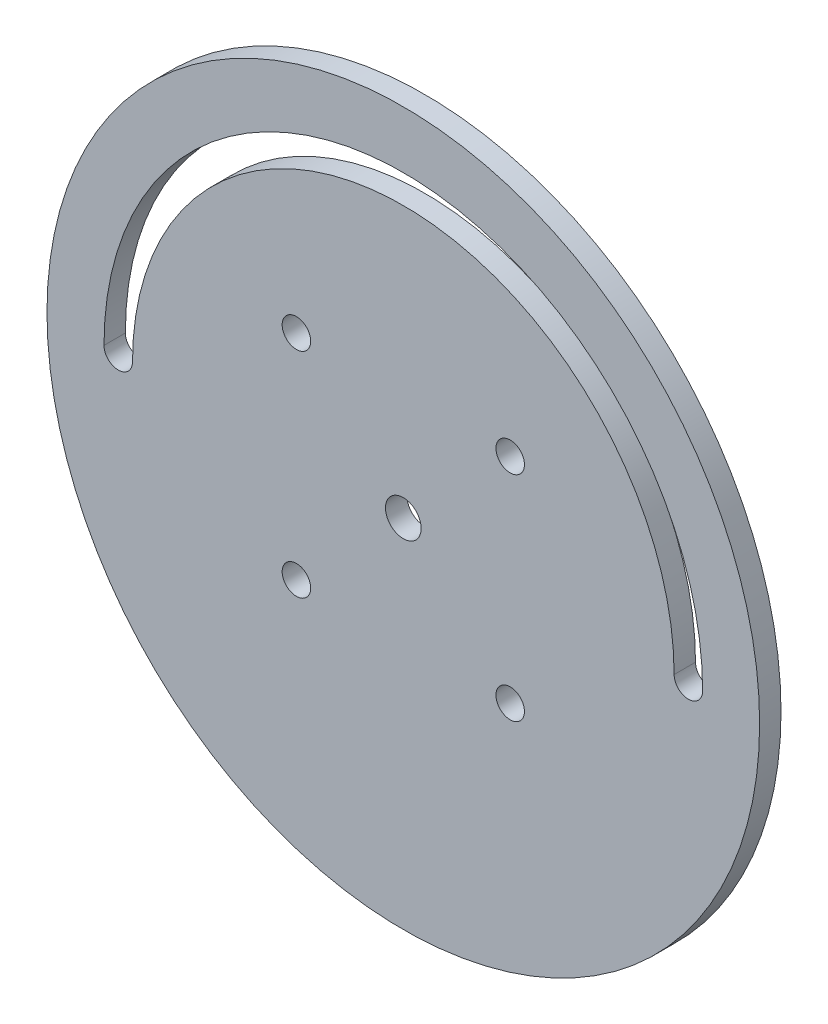
ISO-10303-21;
HEADER;
FILE_DESCRIPTION(('STEP AP214'),'2;1');
FILE_NAME('part.step','',(''),(''),'','','');
FILE_SCHEMA(('AUTOMOTIVE_DESIGN { 1 0 10303 214 1 1 1 1 }'));
ENDSEC;
DATA;
#1=APPLICATION_CONTEXT('core data for automotive mechanical design processes');
#2=APPLICATION_PROTOCOL_DEFINITION('international standard','automotive_design',2000,#1);
#3=PRODUCT_CONTEXT('',#1,'mechanical');
#4=PRODUCT('Part','Part','',(#3));
#5=PRODUCT_RELATED_PRODUCT_CATEGORY('part','',(#4));
#6=PRODUCT_DEFINITION_FORMATION('','',#4);
#7=PRODUCT_DEFINITION_CONTEXT('part definition',#1,'design');
#8=PRODUCT_DEFINITION('design','',#6,#7);
#9=PRODUCT_DEFINITION_SHAPE('','',#8);
#10=(LENGTH_UNIT() NAMED_UNIT(*) SI_UNIT(.MILLI.,.METRE.));
#11=(NAMED_UNIT(*) PLANE_ANGLE_UNIT() SI_UNIT($,.RADIAN.));
#12=(NAMED_UNIT(*) SI_UNIT($,.STERADIAN.) SOLID_ANGLE_UNIT());
#13=UNCERTAINTY_MEASURE_WITH_UNIT(LENGTH_MEASURE(1.E-05),#10,'distance_accuracy_value','');
#14=(GEOMETRIC_REPRESENTATION_CONTEXT(3) GLOBAL_UNCERTAINTY_ASSIGNED_CONTEXT((#13)) GLOBAL_UNIT_ASSIGNED_CONTEXT((#10,
#11,#12)) REPRESENTATION_CONTEXT('',''));
#15=CARTESIAN_POINT('',(0.,0.,0.));
#16=DIRECTION('',(0.,0.,1.));
#17=DIRECTION('',(1.,0.,0.));
#18=AXIS2_PLACEMENT_3D('',#15,#16,#17);
#19=CARTESIAN_POINT('',(0.,0.,3.));
#20=DIRECTION('',(0.,0.,1.));
#21=DIRECTION('',(1.,0.,0.));
#22=AXIS2_PLACEMENT_3D('',#19,#20,#21);
#23=PLANE('',#22);
#24=CARTESIAN_POINT('',(-15.,-15.,3.));
#25=DIRECTION('',(0.,0.,1.));
#26=DIRECTION('',(1.,0.,0.));
#27=AXIS2_PLACEMENT_3D('',#24,#25,#26);
#28=CIRCLE('',#27,2.);
#29=CARTESIAN_POINT('',(-13.,-15.,3.));
#30=VERTEX_POINT('',#29);
#31=EDGE_CURVE('E220',#30,#30,#28,.T.);
#32=ORIENTED_EDGE('',*,*,#31,.F.);
#33=EDGE_LOOP('',(#32));
#34=FACE_BOUND('',#33,.T.);
#35=CARTESIAN_POINT('',(15.,-15.,3.));
#36=DIRECTION('',(0.,0.,1.));
#37=DIRECTION('',(1.,0.,0.));
#38=AXIS2_PLACEMENT_3D('',#35,#36,#37);
#39=CIRCLE('',#38,2.);
#40=CARTESIAN_POINT('',(17.,-15.,3.));
#41=VERTEX_POINT('',#40);
#42=EDGE_CURVE('E222',#41,#41,#39,.T.);
#43=ORIENTED_EDGE('',*,*,#42,.F.);
#44=EDGE_LOOP('',(#43));
#45=FACE_BOUND('',#44,.T.);
#46=CARTESIAN_POINT('',(15.,15.,3.));
#47=DIRECTION('',(0.,0.,1.));
#48=DIRECTION('',(1.,0.,0.));
#49=AXIS2_PLACEMENT_3D('',#46,#47,#48);
#50=CIRCLE('',#49,2.);
#51=CARTESIAN_POINT('',(17.,15.,3.));
#52=VERTEX_POINT('',#51);
#53=EDGE_CURVE('E243',#52,#52,#50,.T.);
#54=ORIENTED_EDGE('',*,*,#53,.F.);
#55=EDGE_LOOP('',(#54));
#56=FACE_BOUND('',#55,.T.);
#57=CARTESIAN_POINT('',(-15.,15.,3.));
#58=DIRECTION('',(0.,0.,1.));
#59=DIRECTION('',(1.,0.,0.));
#60=AXIS2_PLACEMENT_3D('',#57,#58,#59);
#61=CIRCLE('',#60,2.);
#62=CARTESIAN_POINT('',(-13.,15.,3.));
#63=VERTEX_POINT('',#62);
#64=EDGE_CURVE('E230',#63,#63,#61,.T.);
#65=ORIENTED_EDGE('',*,*,#64,.F.);
#66=EDGE_LOOP('',(#65));
#67=FACE_BOUND('',#66,.T.);
#68=CARTESIAN_POINT('',(0.,0.,3.));
#69=DIRECTION('',(0.,0.,1.));
#70=DIRECTION('',(1.,0.,0.));
#71=AXIS2_PLACEMENT_3D('',#68,#69,#70);
#72=CIRCLE('',#71,42.);
#73=CARTESIAN_POINT('',(42.,0.,3.));
#74=VERTEX_POINT('',#73);
#75=CARTESIAN_POINT('',(-42.,0.,3.));
#76=VERTEX_POINT('',#75);
#77=EDGE_CURVE('E82',#74,#76,#72,.T.);
#78=ORIENTED_EDGE('',*,*,#77,.F.);
#79=CARTESIAN_POINT('',(40.,0.,3.));
#80=DIRECTION('',(0.,0.,1.));
#81=DIRECTION('',(1.,0.,0.));
#82=AXIS2_PLACEMENT_3D('',#79,#80,#81);
#83=CIRCLE('',#82,2.00000000000001);
#84=CARTESIAN_POINT('',(38.,0.,3.));
#85=VERTEX_POINT('',#84);
#86=EDGE_CURVE('E74',#85,#74,#83,.T.);
#87=ORIENTED_EDGE('',*,*,#86,.F.);
#88=CARTESIAN_POINT('',(0.,0.,3.));
#89=DIRECTION('',(0.,0.,-1.));
#90=DIRECTION('',(1.,0.,0.));
#91=AXIS2_PLACEMENT_3D('',#88,#89,#90);
#92=CIRCLE('',#91,38.);
#93=CARTESIAN_POINT('',(-38.,0.,3.));
#94=VERTEX_POINT('',#93);
#95=EDGE_CURVE('E96',#94,#85,#92,.T.);
#96=ORIENTED_EDGE('',*,*,#95,.F.);
#97=CARTESIAN_POINT('',(-40.,0.,3.));
#98=DIRECTION('',(0.,0.,1.));
#99=DIRECTION('',(1.,0.,0.));
#100=AXIS2_PLACEMENT_3D('',#97,#98,#99);
#101=CIRCLE('',#100,2.00000000000001);
#102=EDGE_CURVE('E94',#76,#94,#101,.T.);
#103=ORIENTED_EDGE('',*,*,#102,.F.);
#104=EDGE_LOOP('',(#78,#87,#96,#103));
#105=FACE_BOUND('',#104,.T.);
#106=CARTESIAN_POINT('',(0.,0.,3.));
#107=DIRECTION('',(0.,0.,1.));
#108=DIRECTION('',(1.,0.,0.));
#109=AXIS2_PLACEMENT_3D('',#106,#107,#108);
#110=CIRCLE('',#109,50.);
#111=CARTESIAN_POINT('',(50.,0.,3.));
#112=VERTEX_POINT('',#111);
#113=EDGE_CURVE('E11',#112,#112,#110,.T.);
#114=ORIENTED_EDGE('',*,*,#113,.T.);
#115=EDGE_LOOP('',(#114));
#116=FACE_BOUND('',#115,.T.);
#117=CARTESIAN_POINT('',(0.,0.,3.));
#118=DIRECTION('',(0.,0.,1.));
#119=DIRECTION('',(1.,0.,0.));
#120=AXIS2_PLACEMENT_3D('',#117,#118,#119);
#121=CIRCLE('',#120,2.5);
#122=CARTESIAN_POINT('',(2.5,0.,3.));
#123=VERTEX_POINT('',#122);
#124=EDGE_CURVE('E102',#123,#123,#121,.T.);
#125=ORIENTED_EDGE('',*,*,#124,.F.);
#126=EDGE_LOOP('',(#125));
#127=FACE_BOUND('',#126,.T.);
#128=ADVANCED_FACE('F33',(#34,#45,#56,#67,#105,#116,#127),#23,.T.);
#129=CARTESIAN_POINT('',(0.,0.,0.));
#130=DIRECTION('',(0.,0.,1.));
#131=DIRECTION('',(1.,0.,0.));
#132=AXIS2_PLACEMENT_3D('',#129,#130,#131);
#133=PLANE('',#132);
#134=CARTESIAN_POINT('',(-15.,-15.,0.));
#135=DIRECTION('',(0.,0.,1.));
#136=DIRECTION('',(1.,0.,0.));
#137=AXIS2_PLACEMENT_3D('',#134,#135,#136);
#138=CIRCLE('',#137,2.);
#139=CARTESIAN_POINT('',(-13.,-15.,0.));
#140=VERTEX_POINT('',#139);
#141=EDGE_CURVE('E218',#140,#140,#138,.T.);
#142=ORIENTED_EDGE('',*,*,#141,.T.);
#143=EDGE_LOOP('',(#142));
#144=FACE_BOUND('',#143,.T.);
#145=CARTESIAN_POINT('',(15.,-15.,0.));
#146=DIRECTION('',(0.,0.,1.));
#147=DIRECTION('',(1.,0.,0.));
#148=AXIS2_PLACEMENT_3D('',#145,#146,#147);
#149=CIRCLE('',#148,2.);
#150=CARTESIAN_POINT('',(17.,-15.,0.));
#151=VERTEX_POINT('',#150);
#152=EDGE_CURVE('E248',#151,#151,#149,.T.);
#153=ORIENTED_EDGE('',*,*,#152,.T.);
#154=EDGE_LOOP('',(#153));
#155=FACE_BOUND('',#154,.T.);
#156=CARTESIAN_POINT('',(15.,15.,0.));
#157=DIRECTION('',(0.,0.,1.));
#158=DIRECTION('',(1.,0.,0.));
#159=AXIS2_PLACEMENT_3D('',#156,#157,#158);
#160=CIRCLE('',#159,2.);
#161=CARTESIAN_POINT('',(17.,15.,0.));
#162=VERTEX_POINT('',#161);
#163=EDGE_CURVE('E233',#162,#162,#160,.T.);
#164=ORIENTED_EDGE('',*,*,#163,.T.);
#165=EDGE_LOOP('',(#164));
#166=FACE_BOUND('',#165,.T.);
#167=CARTESIAN_POINT('',(-15.,15.,0.));
#168=DIRECTION('',(0.,0.,1.));
#169=DIRECTION('',(1.,0.,0.));
#170=AXIS2_PLACEMENT_3D('',#167,#168,#169);
#171=CIRCLE('',#170,2.);
#172=CARTESIAN_POINT('',(-13.,15.,0.));
#173=VERTEX_POINT('',#172);
#174=EDGE_CURVE('E226',#173,#173,#171,.T.);
#175=ORIENTED_EDGE('',*,*,#174,.T.);
#176=EDGE_LOOP('',(#175));
#177=FACE_BOUND('',#176,.T.);
#178=CARTESIAN_POINT('',(0.,0.,0.));
#179=DIRECTION('',(0.,0.,1.));
#180=DIRECTION('',(1.,0.,0.));
#181=AXIS2_PLACEMENT_3D('',#178,#179,#180);
#182=CIRCLE('',#181,50.);
#183=CARTESIAN_POINT('',(50.,0.,0.));
#184=VERTEX_POINT('',#183);
#185=EDGE_CURVE('E37',#184,#184,#182,.T.);
#186=ORIENTED_EDGE('',*,*,#185,.F.);
#187=EDGE_LOOP('',(#186));
#188=FACE_BOUND('',#187,.T.);
#189=CARTESIAN_POINT('',(40.,0.,0.));
#190=DIRECTION('',(0.,0.,1.));
#191=DIRECTION('',(1.,0.,0.));
#192=AXIS2_PLACEMENT_3D('',#189,#190,#191);
#193=CIRCLE('',#192,2.00000000000001);
#194=CARTESIAN_POINT('',(38.,0.,0.));
#195=VERTEX_POINT('',#194);
#196=CARTESIAN_POINT('',(42.,0.,0.));
#197=VERTEX_POINT('',#196);
#198=EDGE_CURVE('E56',#195,#197,#193,.T.);
#199=ORIENTED_EDGE('',*,*,#198,.T.);
#200=CARTESIAN_POINT('',(0.,0.,0.));
#201=DIRECTION('',(0.,0.,1.));
#202=DIRECTION('',(1.,0.,0.));
#203=AXIS2_PLACEMENT_3D('',#200,#201,#202);
#204=CIRCLE('',#203,42.);
#205=CARTESIAN_POINT('',(-42.,0.,0.));
#206=VERTEX_POINT('',#205);
#207=EDGE_CURVE('E89',#197,#206,#204,.T.);
#208=ORIENTED_EDGE('',*,*,#207,.T.);
#209=CARTESIAN_POINT('',(-40.,0.,0.));
#210=DIRECTION('',(0.,0.,1.));
#211=DIRECTION('',(1.,0.,0.));
#212=AXIS2_PLACEMENT_3D('',#209,#210,#211);
#213=CIRCLE('',#212,2.00000000000001);
#214=CARTESIAN_POINT('',(-38.,0.,0.));
#215=VERTEX_POINT('',#214);
#216=EDGE_CURVE('E104',#206,#215,#213,.T.);
#217=ORIENTED_EDGE('',*,*,#216,.T.);
#218=CARTESIAN_POINT('',(0.,0.,0.));
#219=DIRECTION('',(0.,0.,-1.));
#220=DIRECTION('',(1.,0.,0.));
#221=AXIS2_PLACEMENT_3D('',#218,#219,#220);
#222=CIRCLE('',#221,38.);
#223=EDGE_CURVE('E83',#215,#195,#222,.T.);
#224=ORIENTED_EDGE('',*,*,#223,.T.);
#225=EDGE_LOOP('',(#199,#208,#217,#224));
#226=FACE_BOUND('',#225,.T.);
#227=CARTESIAN_POINT('',(0.,0.,0.));
#228=DIRECTION('',(0.,0.,1.));
#229=DIRECTION('',(1.,0.,0.));
#230=AXIS2_PLACEMENT_3D('',#227,#228,#229);
#231=CIRCLE('',#230,2.5);
#232=CARTESIAN_POINT('',(2.5,0.,0.));
#233=VERTEX_POINT('',#232);
#234=EDGE_CURVE('E229',#233,#233,#231,.T.);
#235=ORIENTED_EDGE('',*,*,#234,.T.);
#236=EDGE_LOOP('',(#235));
#237=FACE_BOUND('',#236,.T.);
#238=ADVANCED_FACE('F115',(#144,#155,#166,#177,#188,#226,#237),#133,.F.);
#239=CARTESIAN_POINT('',(0.,0.,3.));
#240=DIRECTION('',(0.,0.,-1.));
#241=DIRECTION('',(-1.,0.,0.));
#242=AXIS2_PLACEMENT_3D('',#239,#240,#241);
#243=CYLINDRICAL_SURFACE('',#242,50.);
#244=ORIENTED_EDGE('',*,*,#113,.F.);
#245=EDGE_LOOP('',(#244));
#246=FACE_BOUND('',#245,.T.);
#247=ORIENTED_EDGE('',*,*,#185,.T.);
#248=EDGE_LOOP('',(#247));
#249=FACE_BOUND('',#248,.T.);
#250=ADVANCED_FACE('F35',(#246,#249),#243,.T.);
#251=CARTESIAN_POINT('',(40.,0.,3.));
#252=DIRECTION('',(0.,0.,-1.));
#253=DIRECTION('',(-1.,0.,0.));
#254=AXIS2_PLACEMENT_3D('',#251,#252,#253);
#255=CYLINDRICAL_SURFACE('',#254,2.00000000000001);
#256=ORIENTED_EDGE('',*,*,#198,.F.);
#257=DIRECTION('',(0.,0.,-1.));
#258=VECTOR('',#257,1.);
#259=CARTESIAN_POINT('',(38.,0.,3.));
#260=LINE('',#259,#258);
#261=EDGE_CURVE('E78',#85,#195,#260,.T.);
#262=ORIENTED_EDGE('',*,*,#261,.F.);
#263=ORIENTED_EDGE('',*,*,#86,.T.);
#264=DIRECTION('',(0.,0.,-1.));
#265=VECTOR('',#264,1.);
#266=CARTESIAN_POINT('',(42.,0.,3.));
#267=LINE('',#266,#265);
#268=EDGE_CURVE('E77',#74,#197,#267,.T.);
#269=ORIENTED_EDGE('',*,*,#268,.T.);
#270=EDGE_LOOP('',(#256,#262,#263,#269));
#271=FACE_BOUND('',#270,.T.);
#272=ADVANCED_FACE('F76',(#271),#255,.F.);
#273=CARTESIAN_POINT('',(0.,0.,3.));
#274=DIRECTION('',(0.,0.,-1.));
#275=DIRECTION('',(-1.,0.,0.));
#276=AXIS2_PLACEMENT_3D('',#273,#274,#275);
#277=CYLINDRICAL_SURFACE('',#276,42.);
#278=ORIENTED_EDGE('',*,*,#207,.F.);
#279=ORIENTED_EDGE('',*,*,#268,.F.);
#280=ORIENTED_EDGE('',*,*,#77,.T.);
#281=DIRECTION('',(0.,0.,-1.));
#282=VECTOR('',#281,1.);
#283=CARTESIAN_POINT('',(-42.,0.,3.));
#284=LINE('',#283,#282);
#285=EDGE_CURVE('E90',#76,#206,#284,.T.);
#286=ORIENTED_EDGE('',*,*,#285,.T.);
#287=EDGE_LOOP('',(#278,#279,#280,#286));
#288=FACE_BOUND('',#287,.T.);
#289=ADVANCED_FACE('F86',(#288),#277,.F.);
#290=CARTESIAN_POINT('',(-40.,0.,3.));
#291=DIRECTION('',(0.,0.,-1.));
#292=DIRECTION('',(-1.,0.,0.));
#293=AXIS2_PLACEMENT_3D('',#290,#291,#292);
#294=CYLINDRICAL_SURFACE('',#293,2.00000000000001);
#295=ORIENTED_EDGE('',*,*,#216,.F.);
#296=ORIENTED_EDGE('',*,*,#285,.F.);
#297=ORIENTED_EDGE('',*,*,#102,.T.);
#298=DIRECTION('',(0.,0.,-1.));
#299=VECTOR('',#298,1.);
#300=CARTESIAN_POINT('',(-38.,0.,3.));
#301=LINE('',#300,#299);
#302=EDGE_CURVE('E48',#94,#215,#301,.T.);
#303=ORIENTED_EDGE('',*,*,#302,.T.);
#304=EDGE_LOOP('',(#295,#296,#297,#303));
#305=FACE_BOUND('',#304,.T.);
#306=ADVANCED_FACE('F113',(#305),#294,.F.);
#307=CARTESIAN_POINT('',(0.,0.,3.));
#308=DIRECTION('',(0.,0.,-1.));
#309=DIRECTION('',(-1.,0.,0.));
#310=AXIS2_PLACEMENT_3D('',#307,#308,#309);
#311=CYLINDRICAL_SURFACE('',#310,38.);
#312=ORIENTED_EDGE('',*,*,#223,.F.);
#313=ORIENTED_EDGE('',*,*,#302,.F.);
#314=ORIENTED_EDGE('',*,*,#95,.T.);
#315=ORIENTED_EDGE('',*,*,#261,.T.);
#316=EDGE_LOOP('',(#312,#313,#314,#315));
#317=FACE_BOUND('',#316,.T.);
#318=ADVANCED_FACE('F117',(#317),#311,.T.);
#319=CARTESIAN_POINT('',(0.,0.,3.));
#320=DIRECTION('',(0.,0.,-1.));
#321=DIRECTION('',(-1.,0.,0.));
#322=AXIS2_PLACEMENT_3D('',#319,#320,#321);
#323=CYLINDRICAL_SURFACE('',#322,2.5);
#324=ORIENTED_EDGE('',*,*,#124,.T.);
#325=EDGE_LOOP('',(#324));
#326=FACE_BOUND('',#325,.T.);
#327=ORIENTED_EDGE('',*,*,#234,.F.);
#328=EDGE_LOOP('',(#327));
#329=FACE_BOUND('',#328,.T.);
#330=ADVANCED_FACE('F119',(#326,#329),#323,.F.);
#331=CARTESIAN_POINT('',(-15.,15.,0.));
#332=DIRECTION('',(0.,0.,1.));
#333=DIRECTION('',(1.,0.,0.));
#334=AXIS2_PLACEMENT_3D('',#331,#332,#333);
#335=CYLINDRICAL_SURFACE('',#334,2.);
#336=ORIENTED_EDGE('',*,*,#174,.F.);
#337=EDGE_LOOP('',(#336));
#338=FACE_BOUND('',#337,.T.);
#339=ORIENTED_EDGE('',*,*,#64,.T.);
#340=EDGE_LOOP('',(#339));
#341=FACE_BOUND('',#340,.T.);
#342=ADVANCED_FACE('F125',(#338,#341),#335,.F.);
#343=CARTESIAN_POINT('',(15.,15.,0.));
#344=DIRECTION('',(0.,0.,1.));
#345=DIRECTION('',(1.,0.,0.));
#346=AXIS2_PLACEMENT_3D('',#343,#344,#345);
#347=CYLINDRICAL_SURFACE('',#346,2.);
#348=ORIENTED_EDGE('',*,*,#163,.F.);
#349=EDGE_LOOP('',(#348));
#350=FACE_BOUND('',#349,.T.);
#351=ORIENTED_EDGE('',*,*,#53,.T.);
#352=EDGE_LOOP('',(#351));
#353=FACE_BOUND('',#352,.T.);
#354=ADVANCED_FACE('F181',(#350,#353),#347,.F.);
#355=CARTESIAN_POINT('',(15.,-15.,0.));
#356=DIRECTION('',(0.,0.,1.));
#357=DIRECTION('',(1.,0.,0.));
#358=AXIS2_PLACEMENT_3D('',#355,#356,#357);
#359=CYLINDRICAL_SURFACE('',#358,2.);
#360=ORIENTED_EDGE('',*,*,#152,.F.);
#361=EDGE_LOOP('',(#360));
#362=FACE_BOUND('',#361,.T.);
#363=ORIENTED_EDGE('',*,*,#42,.T.);
#364=EDGE_LOOP('',(#363));
#365=FACE_BOUND('',#364,.T.);
#366=ADVANCED_FACE('F191',(#362,#365),#359,.F.);
#367=CARTESIAN_POINT('',(-15.,-15.,0.));
#368=DIRECTION('',(0.,0.,1.));
#369=DIRECTION('',(1.,0.,0.));
#370=AXIS2_PLACEMENT_3D('',#367,#368,#369);
#371=CYLINDRICAL_SURFACE('',#370,2.);
#372=ORIENTED_EDGE('',*,*,#141,.F.);
#373=EDGE_LOOP('',(#372));
#374=FACE_BOUND('',#373,.T.);
#375=ORIENTED_EDGE('',*,*,#31,.T.);
#376=EDGE_LOOP('',(#375));
#377=FACE_BOUND('',#376,.T.);
#378=ADVANCED_FACE('F201',(#374,#377),#371,.F.);
#379=CLOSED_SHELL('',(#128,#238,#250,#272,#289,#306,#318,#330,#342,#354,#366,#378));
#380=MANIFOLD_SOLID_BREP('B2',#379);
#381=ADVANCED_BREP_SHAPE_REPRESENTATION('',(#18,#380),#14);
#382=SHAPE_DEFINITION_REPRESENTATION(#9,#381);
ENDSEC;
END-ISO-10303-21;
